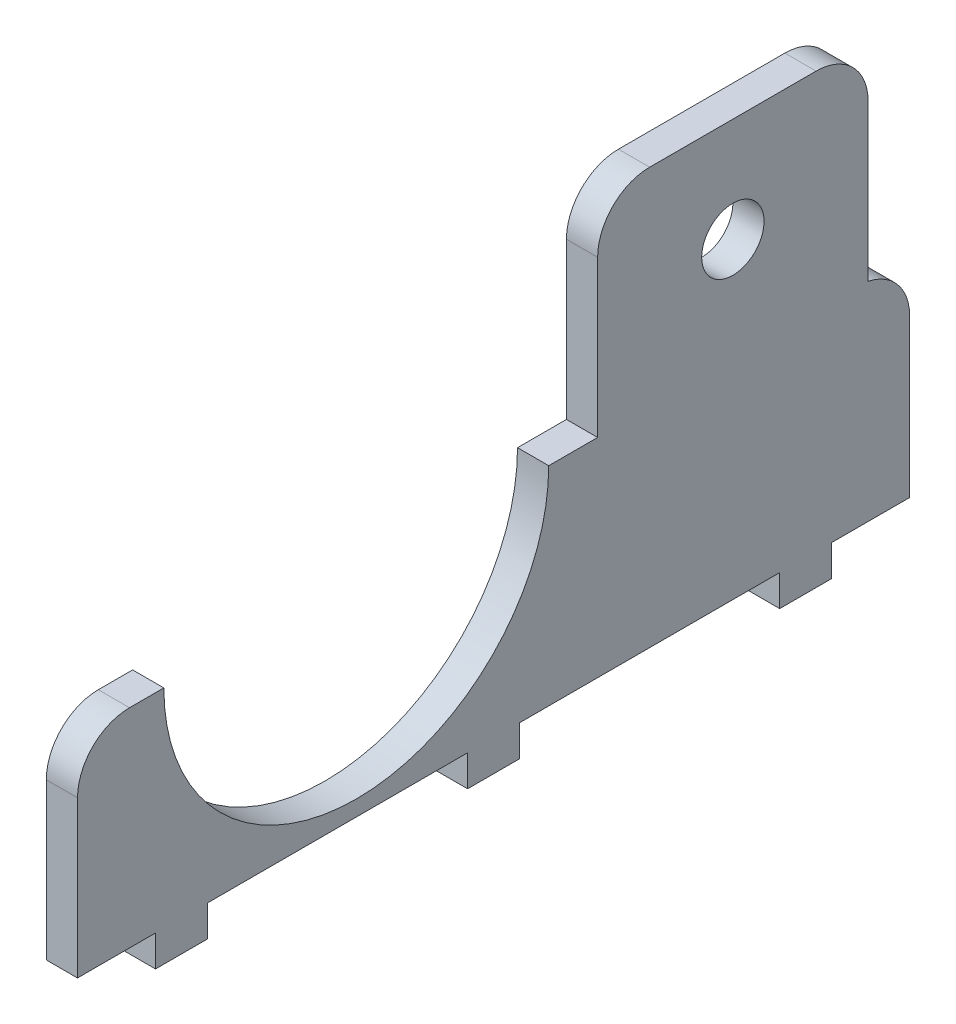
ISO-10303-21;
HEADER;
FILE_DESCRIPTION(('STEP AP214'),'2;1');
FILE_NAME('part.step','',(''),(''),'','','');
FILE_SCHEMA(('AUTOMOTIVE_DESIGN { 1 0 10303 214 1 1 1 1 }'));
ENDSEC;
DATA;
#1=APPLICATION_CONTEXT('core data for automotive mechanical design processes');
#2=APPLICATION_PROTOCOL_DEFINITION('international standard','automotive_design',2000,#1);
#3=PRODUCT_CONTEXT('',#1,'mechanical');
#4=PRODUCT('Part','Part','',(#3));
#5=PRODUCT_RELATED_PRODUCT_CATEGORY('part','',(#4));
#6=PRODUCT_DEFINITION_FORMATION('','',#4);
#7=PRODUCT_DEFINITION_CONTEXT('part definition',#1,'design');
#8=PRODUCT_DEFINITION('design','',#6,#7);
#9=PRODUCT_DEFINITION_SHAPE('','',#8);
#10=(LENGTH_UNIT() NAMED_UNIT(*) SI_UNIT(.MILLI.,.METRE.));
#11=(NAMED_UNIT(*) PLANE_ANGLE_UNIT() SI_UNIT($,.RADIAN.));
#12=(NAMED_UNIT(*) SI_UNIT($,.STERADIAN.) SOLID_ANGLE_UNIT());
#13=UNCERTAINTY_MEASURE_WITH_UNIT(LENGTH_MEASURE(1.E-05),#10,'distance_accuracy_value','');
#14=(GEOMETRIC_REPRESENTATION_CONTEXT(3) GLOBAL_UNCERTAINTY_ASSIGNED_CONTEXT((#13)) GLOBAL_UNIT_ASSIGNED_CONTEXT((#10,
#11,#12)) REPRESENTATION_CONTEXT('',''));
#15=CARTESIAN_POINT('',(0.,0.,0.));
#16=DIRECTION('',(0.,0.,1.));
#17=DIRECTION('',(1.,0.,0.));
#18=AXIS2_PLACEMENT_3D('',#15,#16,#17);
#19=CARTESIAN_POINT('',(3.,-25.,-32.5));
#20=DIRECTION('',(0.,1.,0.));
#21=DIRECTION('',(0.,0.,1.));
#22=AXIS2_PLACEMENT_3D('',#19,#20,#21);
#23=PLANE('',#22);
#24=DIRECTION('',(1.,0.,0.));
#25=VECTOR('',#24,1.);
#26=CARTESIAN_POINT('',(0.,-25.,-25.));
#27=LINE('',#26,#25);
#28=CARTESIAN_POINT('',(0.,-25.,-25.));
#29=VERTEX_POINT('',#28);
#30=CARTESIAN_POINT('',(3.,-25.,-25.));
#31=VERTEX_POINT('',#30);
#32=EDGE_CURVE('E429',#29,#31,#27,.T.);
#33=ORIENTED_EDGE('',*,*,#32,.F.);
#34=DIRECTION('',(0.,0.,-1.));
#35=VECTOR('',#34,1.);
#36=CARTESIAN_POINT('',(0.,-25.,-32.5));
#37=LINE('',#36,#35);
#38=CARTESIAN_POINT('',(0.,-25.,-32.5));
#39=VERTEX_POINT('',#38);
#40=EDGE_CURVE('E229',#29,#39,#37,.T.);
#41=ORIENTED_EDGE('',*,*,#40,.T.);
#42=DIRECTION('',(-1.,0.,0.));
#43=VECTOR('',#42,1.);
#44=CARTESIAN_POINT('',(3.,-25.,-32.5));
#45=LINE('',#44,#43);
#46=CARTESIAN_POINT('',(3.,-25.,-32.5));
#47=VERTEX_POINT('',#46);
#48=EDGE_CURVE('E347',#47,#39,#45,.T.);
#49=ORIENTED_EDGE('',*,*,#48,.F.);
#50=DIRECTION('',(0.,0.,-1.));
#51=VECTOR('',#50,1.);
#52=CARTESIAN_POINT('',(3.,-25.,-32.5));
#53=LINE('',#52,#51);
#54=EDGE_CURVE('E54',#31,#47,#53,.T.);
#55=ORIENTED_EDGE('',*,*,#54,.F.);
#56=EDGE_LOOP('',(#33,#41,#49,#55));
#57=FACE_BOUND('',#56,.T.);
#58=ADVANCED_FACE('F39',(#57),#23,.F.);
#59=DIRECTION('',(-1.,0.,0.));
#60=VECTOR('',#59,1.);
#61=CARTESIAN_POINT('',(0.,-25.,-20.));
#62=LINE('',#61,#60);
#63=CARTESIAN_POINT('',(3.,-25.,-20.));
#64=VERTEX_POINT('',#63);
#65=CARTESIAN_POINT('',(0.,-25.,-20.));
#66=VERTEX_POINT('',#65);
#67=EDGE_CURVE('E62',#64,#66,#62,.T.);
#68=ORIENTED_EDGE('',*,*,#67,.F.);
#69=CARTESIAN_POINT('',(3.,-25.,4.99999999999999));
#70=VERTEX_POINT('',#69);
#71=EDGE_CURVE('E723',#70,#64,#53,.T.);
#72=ORIENTED_EDGE('',*,*,#71,.F.);
#73=DIRECTION('',(1.,0.,0.));
#74=VECTOR('',#73,1.);
#75=CARTESIAN_POINT('',(0.,-25.,4.99999999999999));
#76=LINE('',#75,#74);
#77=CARTESIAN_POINT('',(0.,-25.,4.99999999999999));
#78=VERTEX_POINT('',#77);
#79=EDGE_CURVE('E230',#78,#70,#76,.T.);
#80=ORIENTED_EDGE('',*,*,#79,.F.);
#81=EDGE_CURVE('E426',#78,#66,#37,.T.);
#82=ORIENTED_EDGE('',*,*,#81,.T.);
#83=EDGE_LOOP('',(#68,#72,#80,#82));
#84=FACE_BOUND('',#83,.T.);
#85=ADVANCED_FACE('F478',(#84),#23,.F.);
#86=DIRECTION('',(-1.,0.,0.));
#87=VECTOR('',#86,1.);
#88=CARTESIAN_POINT('',(0.,-25.,9.99999999999999));
#89=LINE('',#88,#87);
#90=CARTESIAN_POINT('',(3.,-25.,9.99999999999999));
#91=VERTEX_POINT('',#90);
#92=CARTESIAN_POINT('',(0.,-25.,9.99999999999999));
#93=VERTEX_POINT('',#92);
#94=EDGE_CURVE('E233',#91,#93,#89,.T.);
#95=ORIENTED_EDGE('',*,*,#94,.F.);
#96=CARTESIAN_POINT('',(3.,-25.,35.));
#97=VERTEX_POINT('',#96);
#98=EDGE_CURVE('E341',#97,#91,#53,.T.);
#99=ORIENTED_EDGE('',*,*,#98,.F.);
#100=DIRECTION('',(1.,0.,0.));
#101=VECTOR('',#100,1.);
#102=CARTESIAN_POINT('',(0.,-25.,35.));
#103=LINE('',#102,#101);
#104=CARTESIAN_POINT('',(0.,-25.,35.));
#105=VERTEX_POINT('',#104);
#106=EDGE_CURVE('E262',#105,#97,#103,.T.);
#107=ORIENTED_EDGE('',*,*,#106,.F.);
#108=EDGE_CURVE('E352',#105,#93,#37,.T.);
#109=ORIENTED_EDGE('',*,*,#108,.T.);
#110=EDGE_LOOP('',(#95,#99,#107,#109));
#111=FACE_BOUND('',#110,.T.);
#112=ADVANCED_FACE('F423',(#111),#23,.F.);
#113=DIRECTION('',(-1.,0.,0.));
#114=VECTOR('',#113,1.);
#115=CARTESIAN_POINT('',(0.,-25.,40.));
#116=LINE('',#115,#114);
#117=CARTESIAN_POINT('',(3.,-25.,40.));
#118=VERTEX_POINT('',#117);
#119=CARTESIAN_POINT('',(0.,-25.,40.));
#120=VERTEX_POINT('',#119);
#121=EDGE_CURVE('E267',#118,#120,#116,.T.);
#122=ORIENTED_EDGE('',*,*,#121,.F.);
#123=CARTESIAN_POINT('',(3.,-25.,47.5));
#124=VERTEX_POINT('',#123);
#125=EDGE_CURVE('E337',#124,#118,#53,.T.);
#126=ORIENTED_EDGE('',*,*,#125,.F.);
#127=DIRECTION('',(-1.,0.,0.));
#128=VECTOR('',#127,1.);
#129=CARTESIAN_POINT('',(3.,-25.,47.5));
#130=LINE('',#129,#128);
#131=CARTESIAN_POINT('',(0.,-25.,47.5));
#132=VERTEX_POINT('',#131);
#133=EDGE_CURVE('E359',#124,#132,#130,.T.);
#134=ORIENTED_EDGE('',*,*,#133,.T.);
#135=EDGE_CURVE('E349',#132,#120,#37,.T.);
#136=ORIENTED_EDGE('',*,*,#135,.T.);
#137=EDGE_LOOP('',(#122,#126,#134,#136));
#138=FACE_BOUND('',#137,.T.);
#139=ADVANCED_FACE('F404',(#138),#23,.F.);
#140=CARTESIAN_POINT('',(3.,-25.,47.5));
#141=DIRECTION('',(0.,0.,-1.));
#142=DIRECTION('',(-1.,0.,0.));
#143=AXIS2_PLACEMENT_3D('',#140,#141,#142);
#144=PLANE('',#143);
#145=DIRECTION('',(0.,-1.,0.));
#146=VECTOR('',#145,1.);
#147=CARTESIAN_POINT('',(3.,-25.,47.5));
#148=LINE('',#147,#146);
#149=CARTESIAN_POINT('',(3.,-9.99999999999999,47.5));
#150=VERTEX_POINT('',#149);
#151=EDGE_CURVE('E334',#150,#124,#148,.T.);
#152=ORIENTED_EDGE('',*,*,#151,.F.);
#153=DIRECTION('',(-1.,0.,0.));
#154=VECTOR('',#153,1.);
#155=CARTESIAN_POINT('',(3.,-9.99999999999999,47.5));
#156=LINE('',#155,#154);
#157=CARTESIAN_POINT('',(0.,-9.99999999999999,47.5));
#158=VERTEX_POINT('',#157);
#159=EDGE_CURVE('E47',#150,#158,#156,.T.);
#160=ORIENTED_EDGE('',*,*,#159,.T.);
#161=DIRECTION('',(0.,-1.,0.));
#162=VECTOR('',#161,1.);
#163=CARTESIAN_POINT('',(0.,-25.,47.5));
#164=LINE('',#163,#162);
#165=EDGE_CURVE('E316',#158,#132,#164,.T.);
#166=ORIENTED_EDGE('',*,*,#165,.T.);
#167=ORIENTED_EDGE('',*,*,#133,.F.);
#168=EDGE_LOOP('',(#152,#160,#166,#167));
#169=FACE_BOUND('',#168,.T.);
#170=ADVANCED_FACE('F394',(#169),#144,.F.);
#171=CARTESIAN_POINT('',(3.,-25.,-32.5));
#172=DIRECTION('',(0.,0.,1.));
#173=DIRECTION('',(1.,0.,0.));
#174=AXIS2_PLACEMENT_3D('',#171,#172,#173);
#175=PLANE('',#174);
#176=DIRECTION('',(0.,1.,0.));
#177=VECTOR('',#176,1.);
#178=CARTESIAN_POINT('',(0.,-25.,-32.5));
#179=LINE('',#178,#177);
#180=CARTESIAN_POINT('',(0.,-9.89897948556634,-32.5));
#181=VERTEX_POINT('',#180);
#182=EDGE_CURVE('E351',#39,#181,#179,.T.);
#183=ORIENTED_EDGE('',*,*,#182,.T.);
#184=DIRECTION('',(-1.,0.,0.));
#185=VECTOR('',#184,1.);
#186=CARTESIAN_POINT('',(3.,-9.89897948556634,-32.5));
#187=LINE('',#186,#185);
#188=CARTESIAN_POINT('',(3.,-9.89897948556634,-32.5));
#189=VERTEX_POINT('',#188);
#190=EDGE_CURVE('E386',#181,#189,#187,.F.);
#191=ORIENTED_EDGE('',*,*,#190,.T.);
#192=DIRECTION('',(0.,1.,0.));
#193=VECTOR('',#192,1.);
#194=CARTESIAN_POINT('',(3.,-25.,-32.5));
#195=LINE('',#194,#193);
#196=EDGE_CURVE('E340',#47,#189,#195,.T.);
#197=ORIENTED_EDGE('',*,*,#196,.F.);
#198=ORIENTED_EDGE('',*,*,#48,.T.);
#199=EDGE_LOOP('',(#183,#191,#197,#198));
#200=FACE_BOUND('',#199,.T.);
#201=ADVANCED_FACE('F431',(#200),#175,.F.);
#202=CARTESIAN_POINT('',(3.,15.,-32.5));
#203=DIRECTION('',(0.,-1.,0.));
#204=DIRECTION('',(0.,0.,-1.));
#205=AXIS2_PLACEMENT_3D('',#202,#203,#204);
#206=PLANE('',#205);
#207=DIRECTION('',(0.,0.,1.));
#208=VECTOR('',#207,1.);
#209=CARTESIAN_POINT('',(0.,15.,-32.5));
#210=LINE('',#209,#208);
#211=CARTESIAN_POINT('',(0.,15.,-23.5));
#212=VERTEX_POINT('',#211);
#213=CARTESIAN_POINT('',(0.,15.,-7.50000000000002));
#214=VERTEX_POINT('',#213);
#215=EDGE_CURVE('E336',#212,#214,#210,.T.);
#216=ORIENTED_EDGE('',*,*,#215,.T.);
#217=DIRECTION('',(-1.,0.,0.));
#218=VECTOR('',#217,1.);
#219=CARTESIAN_POINT('',(3.,15.,-7.50000000000002));
#220=LINE('',#219,#218);
#221=CARTESIAN_POINT('',(3.,15.,-7.50000000000002));
#222=VERTEX_POINT('',#221);
#223=EDGE_CURVE('E376',#214,#222,#220,.F.);
#224=ORIENTED_EDGE('',*,*,#223,.T.);
#225=DIRECTION('',(0.,0.,1.));
#226=VECTOR('',#225,1.);
#227=CARTESIAN_POINT('',(3.,15.,-32.5));
#228=LINE('',#227,#226);
#229=CARTESIAN_POINT('',(3.,15.,-23.5));
#230=VERTEX_POINT('',#229);
#231=EDGE_CURVE('E344',#230,#222,#228,.T.);
#232=ORIENTED_EDGE('',*,*,#231,.F.);
#233=DIRECTION('',(-1.,0.,0.));
#234=VECTOR('',#233,1.);
#235=CARTESIAN_POINT('',(3.,15.,-23.5));
#236=LINE('',#235,#234);
#237=EDGE_CURVE('E373',#230,#212,#236,.T.);
#238=ORIENTED_EDGE('',*,*,#237,.T.);
#239=EDGE_LOOP('',(#216,#224,#232,#238));
#240=FACE_BOUND('',#239,.T.);
#241=ADVANCED_FACE('F449',(#240),#206,.F.);
#242=CARTESIAN_POINT('',(3.,0.,0.));
#243=DIRECTION('',(1.,0.,0.));
#244=DIRECTION('',(0.,0.,-1.));
#245=AXIS2_PLACEMENT_3D('',#242,#243,#244);
#246=PLANE('',#245);
#247=ORIENTED_EDGE('',*,*,#231,.T.);
#248=CARTESIAN_POINT('',(3.,10.,-7.50000000000002));
#249=DIRECTION('',(1.,0.,0.));
#250=DIRECTION('',(0.,0.,-1.));
#251=AXIS2_PLACEMENT_3D('',#248,#249,#250);
#252=CIRCLE('',#251,5.);
#253=CARTESIAN_POINT('',(3.,10.,-2.50000000000002));
#254=VERTEX_POINT('',#253);
#255=EDGE_CURVE('E384',#222,#254,#252,.T.);
#256=ORIENTED_EDGE('',*,*,#255,.T.);
#257=DIRECTION('',(0.,-1.,0.));
#258=VECTOR('',#257,1.);
#259=CARTESIAN_POINT('',(3.,-4.99999999999999,-2.50000000000002));
#260=LINE('',#259,#258);
#261=CARTESIAN_POINT('',(3.,-4.99999999999999,-2.50000000000002));
#262=VERTEX_POINT('',#261);
#263=EDGE_CURVE('E290',#254,#262,#260,.T.);
#264=ORIENTED_EDGE('',*,*,#263,.T.);
#265=DIRECTION('',(0.,0.,1.));
#266=VECTOR('',#265,1.);
#267=CARTESIAN_POINT('',(3.,-4.99999999999999,2.19999999999999));
#268=LINE('',#267,#266);
#269=CARTESIAN_POINT('',(3.,-4.99999999999999,2.19999999999999));
#270=VERTEX_POINT('',#269);
#271=EDGE_CURVE('E292',#262,#270,#268,.T.);
#272=ORIENTED_EDGE('',*,*,#271,.T.);
#273=CARTESIAN_POINT('',(3.,-4.99999999999999,20.7));
#274=DIRECTION('',(-1.,0.,0.));
#275=DIRECTION('',(0.,0.,1.));
#276=AXIS2_PLACEMENT_3D('',#273,#274,#275);
#277=CIRCLE('',#276,18.5);
#278=CARTESIAN_POINT('',(3.,-4.99999999999999,39.2));
#279=VERTEX_POINT('',#278);
#280=EDGE_CURVE('E296',#270,#279,#277,.T.);
#281=ORIENTED_EDGE('',*,*,#280,.T.);
#282=DIRECTION('',(0.,0.,1.));
#283=VECTOR('',#282,1.);
#284=CARTESIAN_POINT('',(3.,-4.99999999999999,39.2));
#285=LINE('',#284,#283);
#286=CARTESIAN_POINT('',(3.,-4.99999999999999,42.5));
#287=VERTEX_POINT('',#286);
#288=EDGE_CURVE('E299',#279,#287,#285,.T.);
#289=ORIENTED_EDGE('',*,*,#288,.T.);
#290=CARTESIAN_POINT('',(3.,-9.99999999999999,42.5));
#291=DIRECTION('',(1.,0.,0.));
#292=DIRECTION('',(0.,0.,-1.));
#293=AXIS2_PLACEMENT_3D('',#290,#291,#292);
#294=CIRCLE('',#293,5.);
#295=EDGE_CURVE('E378',#287,#150,#294,.T.);
#296=ORIENTED_EDGE('',*,*,#295,.T.);
#297=ORIENTED_EDGE('',*,*,#151,.T.);
#298=ORIENTED_EDGE('',*,*,#125,.T.);
#299=DIRECTION('',(0.,1.,0.));
#300=VECTOR('',#299,1.);
#301=CARTESIAN_POINT('',(3.,-28.,40.));
#302=LINE('',#301,#300);
#303=CARTESIAN_POINT('',(3.,-28.,40.));
#304=VERTEX_POINT('',#303);
#305=EDGE_CURVE('E280',#304,#118,#302,.T.);
#306=ORIENTED_EDGE('',*,*,#305,.F.);
#307=DIRECTION('',(0.,0.,1.));
#308=VECTOR('',#307,1.);
#309=CARTESIAN_POINT('',(3.,-28.,40.));
#310=LINE('',#309,#308);
#311=CARTESIAN_POINT('',(3.,-28.,35.));
#312=VERTEX_POINT('',#311);
#313=EDGE_CURVE('E269',#312,#304,#310,.T.);
#314=ORIENTED_EDGE('',*,*,#313,.F.);
#315=DIRECTION('',(0.,1.,0.));
#316=VECTOR('',#315,1.);
#317=CARTESIAN_POINT('',(3.,-28.,35.));
#318=LINE('',#317,#316);
#319=EDGE_CURVE('E283',#312,#97,#318,.T.);
#320=ORIENTED_EDGE('',*,*,#319,.T.);
#321=ORIENTED_EDGE('',*,*,#98,.T.);
#322=DIRECTION('',(0.,1.,0.));
#323=VECTOR('',#322,1.);
#324=CARTESIAN_POINT('',(3.,-28.,9.99999999999999));
#325=LINE('',#324,#323);
#326=CARTESIAN_POINT('',(3.,-28.,9.99999999999999));
#327=VERTEX_POINT('',#326);
#328=EDGE_CURVE('E253',#327,#91,#325,.T.);
#329=ORIENTED_EDGE('',*,*,#328,.F.);
#330=DIRECTION('',(0.,0.,1.));
#331=VECTOR('',#330,1.);
#332=CARTESIAN_POINT('',(3.,-28.,9.99999999999999));
#333=LINE('',#332,#331);
#334=CARTESIAN_POINT('',(3.,-28.,4.99999999999999));
#335=VERTEX_POINT('',#334);
#336=EDGE_CURVE('E244',#335,#327,#333,.T.);
#337=ORIENTED_EDGE('',*,*,#336,.F.);
#338=DIRECTION('',(0.,1.,0.));
#339=VECTOR('',#338,1.);
#340=CARTESIAN_POINT('',(3.,-28.,4.99999999999999));
#341=LINE('',#340,#339);
#342=EDGE_CURVE('E256',#335,#70,#341,.T.);
#343=ORIENTED_EDGE('',*,*,#342,.T.);
#344=ORIENTED_EDGE('',*,*,#71,.T.);
#345=DIRECTION('',(0.,1.,0.));
#346=VECTOR('',#345,1.);
#347=CARTESIAN_POINT('',(3.,-28.,-20.));
#348=LINE('',#347,#346);
#349=CARTESIAN_POINT('',(3.,-28.,-20.));
#350=VERTEX_POINT('',#349);
#351=EDGE_CURVE('E235',#350,#64,#348,.T.);
#352=ORIENTED_EDGE('',*,*,#351,.F.);
#353=DIRECTION('',(0.,0.,1.));
#354=VECTOR('',#353,1.);
#355=CARTESIAN_POINT('',(3.,-28.,-20.));
#356=LINE('',#355,#354);
#357=CARTESIAN_POINT('',(3.,-28.,-25.));
#358=VERTEX_POINT('',#357);
#359=EDGE_CURVE('E215',#358,#350,#356,.T.);
#360=ORIENTED_EDGE('',*,*,#359,.F.);
#361=DIRECTION('',(0.,1.,0.));
#362=VECTOR('',#361,1.);
#363=CARTESIAN_POINT('',(3.,-28.,-25.));
#364=LINE('',#363,#362);
#365=EDGE_CURVE('E212',#358,#31,#364,.T.);
#366=ORIENTED_EDGE('',*,*,#365,.T.);
#367=ORIENTED_EDGE('',*,*,#54,.T.);
#368=ORIENTED_EDGE('',*,*,#196,.T.);
#369=CARTESIAN_POINT('',(3.,-9.89897948556634,-27.5));
#370=DIRECTION('',(1.,0.,0.));
#371=DIRECTION('',(0.,0.,-1.));
#372=AXIS2_PLACEMENT_3D('',#369,#370,#371);
#373=CIRCLE('',#372,5.);
#374=CARTESIAN_POINT('',(3.,-4.99999999999998,-28.5));
#375=VERTEX_POINT('',#374);
#376=EDGE_CURVE('E382',#189,#375,#373,.T.);
#377=ORIENTED_EDGE('',*,*,#376,.T.);
#378=DIRECTION('',(0.,1.,0.));
#379=VECTOR('',#378,1.);
#380=CARTESIAN_POINT('',(3.,-4.99999999999998,-28.5));
#381=LINE('',#380,#379);
#382=CARTESIAN_POINT('',(3.,10.,-28.5));
#383=VERTEX_POINT('',#382);
#384=EDGE_CURVE('E327',#375,#383,#381,.T.);
#385=ORIENTED_EDGE('',*,*,#384,.T.);
#386=CARTESIAN_POINT('',(3.,10.,-23.5));
#387=DIRECTION('',(1.,0.,0.));
#388=DIRECTION('',(0.,0.,-1.));
#389=AXIS2_PLACEMENT_3D('',#386,#387,#388);
#390=CIRCLE('',#389,5.);
#391=EDGE_CURVE('E380',#383,#230,#390,.T.);
#392=ORIENTED_EDGE('',*,*,#391,.T.);
#393=EDGE_LOOP('',(#247,#256,#264,#272,#281,#289,#296,#297,#298,#306,#314,#320,#321,#329,#337,
#343,#344,#352,#360,#366,#367,#368,#377,#385,#392));
#394=FACE_BOUND('',#393,.T.);
#395=CARTESIAN_POINT('',(3.,5.00000000000001,-15.5));
#396=DIRECTION('',(-1.,0.,0.));
#397=DIRECTION('',(0.,0.,1.));
#398=AXIS2_PLACEMENT_3D('',#395,#396,#397);
#399=CIRCLE('',#398,3.);
#400=CARTESIAN_POINT('',(3.,5.00000000000001,-12.5));
#401=VERTEX_POINT('',#400);
#402=EDGE_CURVE('E306',#401,#401,#399,.T.);
#403=ORIENTED_EDGE('',*,*,#402,.T.);
#404=EDGE_LOOP('',(#403));
#405=FACE_BOUND('',#404,.T.);
#406=ADVANCED_FACE('F407',(#394,#405),#246,.T.);
#407=CARTESIAN_POINT('',(0.,0.,0.));
#408=DIRECTION('',(1.,0.,0.));
#409=DIRECTION('',(0.,0.,-1.));
#410=AXIS2_PLACEMENT_3D('',#407,#408,#409);
#411=PLANE('',#410);
#412=CARTESIAN_POINT('',(0.,5.00000000000001,-15.5));
#413=DIRECTION('',(-1.,0.,0.));
#414=DIRECTION('',(0.,0.,1.));
#415=AXIS2_PLACEMENT_3D('',#412,#413,#414);
#416=CIRCLE('',#415,3.);
#417=CARTESIAN_POINT('',(0.,5.00000000000001,-12.5));
#418=VERTEX_POINT('',#417);
#419=EDGE_CURVE('E323',#418,#418,#416,.T.);
#420=ORIENTED_EDGE('',*,*,#419,.F.);
#421=EDGE_LOOP('',(#420));
#422=FACE_BOUND('',#421,.T.);
#423=DIRECTION('',(0.,-1.,0.));
#424=VECTOR('',#423,1.);
#425=CARTESIAN_POINT('',(0.,-4.99999999999999,-2.50000000000002));
#426=LINE('',#425,#424);
#427=CARTESIAN_POINT('',(0.,10.,-2.50000000000002));
#428=VERTEX_POINT('',#427);
#429=CARTESIAN_POINT('',(0.,-4.99999999999999,-2.50000000000002));
#430=VERTEX_POINT('',#429);
#431=EDGE_CURVE('E303',#428,#430,#426,.T.);
#432=ORIENTED_EDGE('',*,*,#431,.F.);
#433=CARTESIAN_POINT('',(0.,10.,-7.50000000000002));
#434=DIRECTION('',(1.,0.,0.));
#435=DIRECTION('',(0.,0.,-1.));
#436=AXIS2_PLACEMENT_3D('',#433,#434,#435);
#437=CIRCLE('',#436,5.);
#438=EDGE_CURVE('E371',#428,#214,#437,.F.);
#439=ORIENTED_EDGE('',*,*,#438,.T.);
#440=ORIENTED_EDGE('',*,*,#215,.F.);
#441=CARTESIAN_POINT('',(0.,10.,-23.5));
#442=DIRECTION('',(1.,0.,0.));
#443=DIRECTION('',(0.,0.,-1.));
#444=AXIS2_PLACEMENT_3D('',#441,#442,#443);
#445=CIRCLE('',#444,5.);
#446=CARTESIAN_POINT('',(0.,10.,-28.5));
#447=VERTEX_POINT('',#446);
#448=EDGE_CURVE('E367',#212,#447,#445,.F.);
#449=ORIENTED_EDGE('',*,*,#448,.T.);
#450=DIRECTION('',(0.,1.,0.));
#451=VECTOR('',#450,1.);
#452=CARTESIAN_POINT('',(0.,-4.99999999999998,-28.5));
#453=LINE('',#452,#451);
#454=CARTESIAN_POINT('',(0.,-4.99999999999998,-28.5));
#455=VERTEX_POINT('',#454);
#456=EDGE_CURVE('E289',#455,#447,#453,.T.);
#457=ORIENTED_EDGE('',*,*,#456,.F.);
#458=CARTESIAN_POINT('',(0.,-9.89897948556634,-27.5));
#459=DIRECTION('',(1.,0.,0.));
#460=DIRECTION('',(0.,0.,-1.));
#461=AXIS2_PLACEMENT_3D('',#458,#459,#460);
#462=CIRCLE('',#461,5.);
#463=EDGE_CURVE('E369',#455,#181,#462,.F.);
#464=ORIENTED_EDGE('',*,*,#463,.T.);
#465=ORIENTED_EDGE('',*,*,#182,.F.);
#466=ORIENTED_EDGE('',*,*,#40,.F.);
#467=DIRECTION('',(0.,1.,0.));
#468=VECTOR('',#467,1.);
#469=CARTESIAN_POINT('',(0.,-28.,-25.));
#470=LINE('',#469,#468);
#471=CARTESIAN_POINT('',(0.,-28.,-25.));
#472=VERTEX_POINT('',#471);
#473=EDGE_CURVE('E210',#472,#29,#470,.T.);
#474=ORIENTED_EDGE('',*,*,#473,.F.);
#475=DIRECTION('',(0.,0.,-1.));
#476=VECTOR('',#475,1.);
#477=CARTESIAN_POINT('',(0.,-28.,-20.));
#478=LINE('',#477,#476);
#479=CARTESIAN_POINT('',(0.,-28.,-20.));
#480=VERTEX_POINT('',#479);
#481=EDGE_CURVE('E216',#480,#472,#478,.T.);
#482=ORIENTED_EDGE('',*,*,#481,.F.);
#483=DIRECTION('',(0.,1.,0.));
#484=VECTOR('',#483,1.);
#485=CARTESIAN_POINT('',(0.,-28.,-20.));
#486=LINE('',#485,#484);
#487=EDGE_CURVE('E715',#480,#66,#486,.T.);
#488=ORIENTED_EDGE('',*,*,#487,.T.);
#489=ORIENTED_EDGE('',*,*,#81,.F.);
#490=DIRECTION('',(0.,1.,0.));
#491=VECTOR('',#490,1.);
#492=CARTESIAN_POINT('',(0.,-28.,4.99999999999999));
#493=LINE('',#492,#491);
#494=CARTESIAN_POINT('',(0.,-28.,4.99999999999999));
#495=VERTEX_POINT('',#494);
#496=EDGE_CURVE('E259',#495,#78,#493,.T.);
#497=ORIENTED_EDGE('',*,*,#496,.F.);
#498=DIRECTION('',(0.,0.,-1.));
#499=VECTOR('',#498,1.);
#500=CARTESIAN_POINT('',(0.,-28.,9.99999999999999));
#501=LINE('',#500,#499);
#502=CARTESIAN_POINT('',(0.,-28.,9.99999999999999));
#503=VERTEX_POINT('',#502);
#504=EDGE_CURVE('E239',#503,#495,#501,.T.);
#505=ORIENTED_EDGE('',*,*,#504,.F.);
#506=DIRECTION('',(0.,1.,0.));
#507=VECTOR('',#506,1.);
#508=CARTESIAN_POINT('',(0.,-28.,9.99999999999999));
#509=LINE('',#508,#507);
#510=EDGE_CURVE('E247',#503,#93,#509,.T.);
#511=ORIENTED_EDGE('',*,*,#510,.T.);
#512=ORIENTED_EDGE('',*,*,#108,.F.);
#513=DIRECTION('',(0.,1.,0.));
#514=VECTOR('',#513,1.);
#515=CARTESIAN_POINT('',(0.,-28.,35.));
#516=LINE('',#515,#514);
#517=CARTESIAN_POINT('',(0.,-28.,35.));
#518=VERTEX_POINT('',#517);
#519=EDGE_CURVE('E286',#518,#105,#516,.T.);
#520=ORIENTED_EDGE('',*,*,#519,.F.);
#521=DIRECTION('',(0.,0.,-1.));
#522=VECTOR('',#521,1.);
#523=CARTESIAN_POINT('',(0.,-28.,40.));
#524=LINE('',#523,#522);
#525=CARTESIAN_POINT('',(0.,-28.,40.));
#526=VERTEX_POINT('',#525);
#527=EDGE_CURVE('E263',#526,#518,#524,.T.);
#528=ORIENTED_EDGE('',*,*,#527,.F.);
#529=DIRECTION('',(0.,1.,0.));
#530=VECTOR('',#529,1.);
#531=CARTESIAN_POINT('',(0.,-28.,40.));
#532=LINE('',#531,#530);
#533=EDGE_CURVE('E273',#526,#120,#532,.T.);
#534=ORIENTED_EDGE('',*,*,#533,.T.);
#535=ORIENTED_EDGE('',*,*,#135,.F.);
#536=ORIENTED_EDGE('',*,*,#165,.F.);
#537=CARTESIAN_POINT('',(0.,-9.99999999999999,42.5));
#538=DIRECTION('',(1.,0.,0.));
#539=DIRECTION('',(0.,0.,-1.));
#540=AXIS2_PLACEMENT_3D('',#537,#538,#539);
#541=CIRCLE('',#540,5.);
#542=CARTESIAN_POINT('',(0.,-4.99999999999999,42.5));
#543=VERTEX_POINT('',#542);
#544=EDGE_CURVE('E365',#158,#543,#541,.F.);
#545=ORIENTED_EDGE('',*,*,#544,.T.);
#546=DIRECTION('',(0.,0.,1.));
#547=VECTOR('',#546,1.);
#548=CARTESIAN_POINT('',(0.,-4.99999999999999,39.2));
#549=LINE('',#548,#547);
#550=CARTESIAN_POINT('',(0.,-4.99999999999999,39.2));
#551=VERTEX_POINT('',#550);
#552=EDGE_CURVE('E293',#551,#543,#549,.T.);
#553=ORIENTED_EDGE('',*,*,#552,.F.);
#554=CARTESIAN_POINT('',(0.,-4.99999999999999,20.7));
#555=DIRECTION('',(-1.,0.,0.));
#556=DIRECTION('',(0.,0.,1.));
#557=AXIS2_PLACEMENT_3D('',#554,#555,#556);
#558=CIRCLE('',#557,18.5);
#559=CARTESIAN_POINT('',(0.,-4.99999999999999,2.19999999999999));
#560=VERTEX_POINT('',#559);
#561=EDGE_CURVE('E309',#560,#551,#558,.T.);
#562=ORIENTED_EDGE('',*,*,#561,.F.);
#563=DIRECTION('',(0.,0.,1.));
#564=VECTOR('',#563,1.);
#565=CARTESIAN_POINT('',(0.,-4.99999999999999,2.19999999999999));
#566=LINE('',#565,#564);
#567=EDGE_CURVE('E305',#430,#560,#566,.T.);
#568=ORIENTED_EDGE('',*,*,#567,.F.);
#569=EDGE_LOOP('',(#432,#439,#440,#449,#457,#464,#465,#466,#474,#482,#488,#489,#497,#505,#511,
#512,#520,#528,#534,#535,#536,#545,#553,#562,#568));
#570=FACE_BOUND('',#569,.T.);
#571=ADVANCED_FACE('F227',(#422,#570),#411,.F.);
#572=CARTESIAN_POINT('',(3.,-4.99999999999998,-28.5));
#573=DIRECTION('',(0.,0.,1.));
#574=DIRECTION('',(1.,0.,0.));
#575=AXIS2_PLACEMENT_3D('',#572,#573,#574);
#576=PLANE('',#575);
#577=ORIENTED_EDGE('',*,*,#456,.T.);
#578=DIRECTION('',(-1.,0.,0.));
#579=VECTOR('',#578,1.);
#580=CARTESIAN_POINT('',(3.,10.,-28.5));
#581=LINE('',#580,#579);
#582=EDGE_CURVE('E388',#447,#383,#581,.F.);
#583=ORIENTED_EDGE('',*,*,#582,.T.);
#584=ORIENTED_EDGE('',*,*,#384,.F.);
#585=DIRECTION('',(-1.,0.,0.));
#586=VECTOR('',#585,1.);
#587=CARTESIAN_POINT('',(3.,-4.99999999999998,-28.5));
#588=LINE('',#587,#586);
#589=EDGE_CURVE('E326',#375,#455,#588,.T.);
#590=ORIENTED_EDGE('',*,*,#589,.T.);
#591=EDGE_LOOP('',(#577,#583,#584,#590));
#592=FACE_BOUND('',#591,.T.);
#593=ADVANCED_FACE('F440',(#592),#576,.F.);
#594=CARTESIAN_POINT('',(3.,5.00000000000001,-15.5));
#595=DIRECTION('',(-1.,0.,0.));
#596=DIRECTION('',(0.,0.,1.));
#597=AXIS2_PLACEMENT_3D('',#594,#595,#596);
#598=CYLINDRICAL_SURFACE('',#597,3.);
#599=ORIENTED_EDGE('',*,*,#402,.F.);
#600=EDGE_LOOP('',(#599));
#601=FACE_BOUND('',#600,.T.);
#602=ORIENTED_EDGE('',*,*,#419,.T.);
#603=EDGE_LOOP('',(#602));
#604=FACE_BOUND('',#603,.T.);
#605=ADVANCED_FACE('F577',(#601,#604),#598,.F.);
#606=CARTESIAN_POINT('',(3.,-4.99999999999999,39.2));
#607=DIRECTION('',(0.,-1.,0.));
#608=DIRECTION('',(0.,0.,-1.));
#609=AXIS2_PLACEMENT_3D('',#606,#607,#608);
#610=PLANE('',#609);
#611=ORIENTED_EDGE('',*,*,#552,.T.);
#612=DIRECTION('',(-1.,0.,0.));
#613=VECTOR('',#612,1.);
#614=CARTESIAN_POINT('',(3.,-4.99999999999999,42.5));
#615=LINE('',#614,#613);
#616=EDGE_CURVE('E11',#543,#287,#615,.F.);
#617=ORIENTED_EDGE('',*,*,#616,.T.);
#618=ORIENTED_EDGE('',*,*,#288,.F.);
#619=DIRECTION('',(-1.,0.,0.));
#620=VECTOR('',#619,1.);
#621=CARTESIAN_POINT('',(3.,-4.99999999999999,39.2));
#622=LINE('',#621,#620);
#623=EDGE_CURVE('E314',#279,#551,#622,.T.);
#624=ORIENTED_EDGE('',*,*,#623,.T.);
#625=EDGE_LOOP('',(#611,#617,#618,#624));
#626=FACE_BOUND('',#625,.T.);
#627=ADVANCED_FACE('F469',(#626),#610,.F.);
#628=CARTESIAN_POINT('',(3.,-4.99999999999999,20.7));
#629=DIRECTION('',(-1.,0.,0.));
#630=DIRECTION('',(0.,0.,1.));
#631=AXIS2_PLACEMENT_3D('',#628,#629,#630);
#632=CYLINDRICAL_SURFACE('',#631,18.5);
#633=ORIENTED_EDGE('',*,*,#561,.T.);
#634=ORIENTED_EDGE('',*,*,#623,.F.);
#635=ORIENTED_EDGE('',*,*,#280,.F.);
#636=DIRECTION('',(-1.,0.,0.));
#637=VECTOR('',#636,1.);
#638=CARTESIAN_POINT('',(3.,-4.99999999999999,2.19999999999999));
#639=LINE('',#638,#637);
#640=EDGE_CURVE('E317',#270,#560,#639,.T.);
#641=ORIENTED_EDGE('',*,*,#640,.T.);
#642=EDGE_LOOP('',(#633,#634,#635,#641));
#643=FACE_BOUND('',#642,.T.);
#644=ADVANCED_FACE('F466',(#643),#632,.F.);
#645=CARTESIAN_POINT('',(3.,-4.99999999999999,2.19999999999999));
#646=DIRECTION('',(0.,-1.,0.));
#647=DIRECTION('',(0.,0.,-1.));
#648=AXIS2_PLACEMENT_3D('',#645,#646,#647);
#649=PLANE('',#648);
#650=ORIENTED_EDGE('',*,*,#567,.T.);
#651=ORIENTED_EDGE('',*,*,#640,.F.);
#652=ORIENTED_EDGE('',*,*,#271,.F.);
#653=DIRECTION('',(-1.,0.,0.));
#654=VECTOR('',#653,1.);
#655=CARTESIAN_POINT('',(3.,-4.99999999999999,-2.50000000000002));
#656=LINE('',#655,#654);
#657=EDGE_CURVE('E302',#262,#430,#656,.T.);
#658=ORIENTED_EDGE('',*,*,#657,.T.);
#659=EDGE_LOOP('',(#650,#651,#652,#658));
#660=FACE_BOUND('',#659,.T.);
#661=ADVANCED_FACE('F463',(#660),#649,.F.);
#662=CARTESIAN_POINT('',(3.,-4.99999999999999,-2.50000000000002));
#663=DIRECTION('',(0.,0.,-1.));
#664=DIRECTION('',(0.,1.,0.));
#665=AXIS2_PLACEMENT_3D('',#662,#663,#664);
#666=PLANE('',#665);
#667=ORIENTED_EDGE('',*,*,#263,.F.);
#668=DIRECTION('',(-1.,0.,0.));
#669=VECTOR('',#668,1.);
#670=CARTESIAN_POINT('',(3.,10.,-2.50000000000002));
#671=LINE('',#670,#669);
#672=EDGE_CURVE('E362',#254,#428,#671,.T.);
#673=ORIENTED_EDGE('',*,*,#672,.T.);
#674=ORIENTED_EDGE('',*,*,#431,.T.);
#675=ORIENTED_EDGE('',*,*,#657,.F.);
#676=EDGE_LOOP('',(#667,#673,#674,#675));
#677=FACE_BOUND('',#676,.T.);
#678=ADVANCED_FACE('F458',(#677),#666,.F.);
#679=CARTESIAN_POINT('',(3.,10.,-7.50000000000002));
#680=DIRECTION('',(-1.,0.,0.));
#681=DIRECTION('',(0.,0.,1.));
#682=AXIS2_PLACEMENT_3D('',#679,#680,#681);
#683=CYLINDRICAL_SURFACE('',#682,5.);
#684=ORIENTED_EDGE('',*,*,#255,.F.);
#685=ORIENTED_EDGE('',*,*,#223,.F.);
#686=ORIENTED_EDGE('',*,*,#438,.F.);
#687=ORIENTED_EDGE('',*,*,#672,.F.);
#688=EDGE_LOOP('',(#684,#685,#686,#687));
#689=FACE_BOUND('',#688,.T.);
#690=ADVANCED_FACE('F455',(#689),#683,.T.);
#691=CARTESIAN_POINT('',(3.,-9.89897948556634,-27.5));
#692=DIRECTION('',(-1.,0.,0.));
#693=DIRECTION('',(0.,0.,1.));
#694=AXIS2_PLACEMENT_3D('',#691,#692,#693);
#695=CYLINDRICAL_SURFACE('',#694,5.);
#696=ORIENTED_EDGE('',*,*,#376,.F.);
#697=ORIENTED_EDGE('',*,*,#190,.F.);
#698=ORIENTED_EDGE('',*,*,#463,.F.);
#699=ORIENTED_EDGE('',*,*,#589,.F.);
#700=EDGE_LOOP('',(#696,#697,#698,#699));
#701=FACE_BOUND('',#700,.T.);
#702=ADVANCED_FACE('F437',(#701),#695,.T.);
#703=CARTESIAN_POINT('',(3.,10.,-23.5));
#704=DIRECTION('',(-1.,0.,0.));
#705=DIRECTION('',(0.,0.,1.));
#706=AXIS2_PLACEMENT_3D('',#703,#704,#705);
#707=CYLINDRICAL_SURFACE('',#706,5.);
#708=ORIENTED_EDGE('',*,*,#391,.F.);
#709=ORIENTED_EDGE('',*,*,#582,.F.);
#710=ORIENTED_EDGE('',*,*,#448,.F.);
#711=ORIENTED_EDGE('',*,*,#237,.F.);
#712=EDGE_LOOP('',(#708,#709,#710,#711));
#713=FACE_BOUND('',#712,.T.);
#714=ADVANCED_FACE('F446',(#713),#707,.T.);
#715=CARTESIAN_POINT('',(3.,-9.99999999999999,42.5));
#716=DIRECTION('',(-1.,0.,0.));
#717=DIRECTION('',(0.,0.,1.));
#718=AXIS2_PLACEMENT_3D('',#715,#716,#717);
#719=CYLINDRICAL_SURFACE('',#718,5.);
#720=ORIENTED_EDGE('',*,*,#295,.F.);
#721=ORIENTED_EDGE('',*,*,#616,.F.);
#722=ORIENTED_EDGE('',*,*,#544,.F.);
#723=ORIENTED_EDGE('',*,*,#159,.F.);
#724=EDGE_LOOP('',(#720,#721,#722,#723));
#725=FACE_BOUND('',#724,.T.);
#726=ADVANCED_FACE('F41',(#725),#719,.T.);
#727=CARTESIAN_POINT('',(0.,-28.,35.));
#728=DIRECTION('',(0.,0.,1.));
#729=DIRECTION('',(0.,-1.,0.));
#730=AXIS2_PLACEMENT_3D('',#727,#728,#729);
#731=PLANE('',#730);
#732=ORIENTED_EDGE('',*,*,#106,.T.);
#733=ORIENTED_EDGE('',*,*,#319,.F.);
#734=DIRECTION('',(1.,0.,0.));
#735=VECTOR('',#734,1.);
#736=CARTESIAN_POINT('',(0.,-28.,35.));
#737=LINE('',#736,#735);
#738=EDGE_CURVE('E266',#518,#312,#737,.T.);
#739=ORIENTED_EDGE('',*,*,#738,.F.);
#740=ORIENTED_EDGE('',*,*,#519,.T.);
#741=EDGE_LOOP('',(#732,#733,#739,#740));
#742=FACE_BOUND('',#741,.T.);
#743=ADVANCED_FACE('F420',(#742),#731,.F.);
#744=CARTESIAN_POINT('',(0.,-28.,40.));
#745=DIRECTION('',(0.,0.,-1.));
#746=DIRECTION('',(0.,1.,0.));
#747=AXIS2_PLACEMENT_3D('',#744,#745,#746);
#748=PLANE('',#747);
#749=ORIENTED_EDGE('',*,*,#121,.T.);
#750=ORIENTED_EDGE('',*,*,#533,.F.);
#751=DIRECTION('',(-1.,0.,0.));
#752=VECTOR('',#751,1.);
#753=CARTESIAN_POINT('',(0.,-28.,40.));
#754=LINE('',#753,#752);
#755=EDGE_CURVE('E271',#304,#526,#754,.T.);
#756=ORIENTED_EDGE('',*,*,#755,.F.);
#757=ORIENTED_EDGE('',*,*,#305,.T.);
#758=EDGE_LOOP('',(#749,#750,#756,#757));
#759=FACE_BOUND('',#758,.T.);
#760=ADVANCED_FACE('F412',(#759),#748,.F.);
#761=CARTESIAN_POINT('',(0.,-28.,0.));
#762=DIRECTION('',(0.,-1.,0.));
#763=DIRECTION('',(0.,0.,-1.));
#764=AXIS2_PLACEMENT_3D('',#761,#762,#763);
#765=PLANE('',#764);
#766=ORIENTED_EDGE('',*,*,#527,.T.);
#767=ORIENTED_EDGE('',*,*,#738,.T.);
#768=ORIENTED_EDGE('',*,*,#313,.T.);
#769=ORIENTED_EDGE('',*,*,#755,.T.);
#770=EDGE_LOOP('',(#766,#767,#768,#769));
#771=FACE_BOUND('',#770,.T.);
#772=ADVANCED_FACE('F414',(#771),#765,.T.);
#773=CARTESIAN_POINT('',(0.,-28.,4.99999999999999));
#774=DIRECTION('',(0.,0.,1.));
#775=DIRECTION('',(0.,-1.,0.));
#776=AXIS2_PLACEMENT_3D('',#773,#774,#775);
#777=PLANE('',#776);
#778=ORIENTED_EDGE('',*,*,#79,.T.);
#779=ORIENTED_EDGE('',*,*,#342,.F.);
#780=DIRECTION('',(1.,0.,0.));
#781=VECTOR('',#780,1.);
#782=CARTESIAN_POINT('',(0.,-28.,4.99999999999999));
#783=LINE('',#782,#781);
#784=EDGE_CURVE('E242',#495,#335,#783,.T.);
#785=ORIENTED_EDGE('',*,*,#784,.F.);
#786=ORIENTED_EDGE('',*,*,#496,.T.);
#787=EDGE_LOOP('',(#778,#779,#785,#786));
#788=FACE_BOUND('',#787,.T.);
#789=ADVANCED_FACE('F511',(#788),#777,.F.);
#790=CARTESIAN_POINT('',(0.,-28.,9.99999999999999));
#791=DIRECTION('',(0.,0.,-1.));
#792=DIRECTION('',(0.,1.,0.));
#793=AXIS2_PLACEMENT_3D('',#790,#791,#792);
#794=PLANE('',#793);
#795=ORIENTED_EDGE('',*,*,#94,.T.);
#796=ORIENTED_EDGE('',*,*,#510,.F.);
#797=DIRECTION('',(-1.,0.,0.));
#798=VECTOR('',#797,1.);
#799=CARTESIAN_POINT('',(0.,-28.,9.99999999999999));
#800=LINE('',#799,#798);
#801=EDGE_CURVE('E246',#327,#503,#800,.T.);
#802=ORIENTED_EDGE('',*,*,#801,.F.);
#803=ORIENTED_EDGE('',*,*,#328,.T.);
#804=EDGE_LOOP('',(#795,#796,#802,#803));
#805=FACE_BOUND('',#804,.T.);
#806=ADVANCED_FACE('F665',(#805),#794,.F.);
#807=CARTESIAN_POINT('',(0.,-28.,-30.));
#808=DIRECTION('',(0.,-1.,0.));
#809=DIRECTION('',(0.,0.,-1.));
#810=AXIS2_PLACEMENT_3D('',#807,#808,#809);
#811=PLANE('',#810);
#812=ORIENTED_EDGE('',*,*,#504,.T.);
#813=ORIENTED_EDGE('',*,*,#784,.T.);
#814=ORIENTED_EDGE('',*,*,#336,.T.);
#815=ORIENTED_EDGE('',*,*,#801,.T.);
#816=EDGE_LOOP('',(#812,#813,#814,#815));
#817=FACE_BOUND('',#816,.T.);
#818=ADVANCED_FACE('F674',(#817),#811,.T.);
#819=CARTESIAN_POINT('',(0.,-28.,-25.));
#820=DIRECTION('',(0.,0.,1.));
#821=DIRECTION('',(0.,-1.,0.));
#822=AXIS2_PLACEMENT_3D('',#819,#820,#821);
#823=PLANE('',#822);
#824=ORIENTED_EDGE('',*,*,#32,.T.);
#825=ORIENTED_EDGE('',*,*,#365,.F.);
#826=DIRECTION('',(1.,0.,0.));
#827=VECTOR('',#826,1.);
#828=CARTESIAN_POINT('',(0.,-28.,-25.));
#829=LINE('',#828,#827);
#830=EDGE_CURVE('E206',#472,#358,#829,.T.);
#831=ORIENTED_EDGE('',*,*,#830,.F.);
#832=ORIENTED_EDGE('',*,*,#473,.T.);
#833=EDGE_LOOP('',(#824,#825,#831,#832));
#834=FACE_BOUND('',#833,.T.);
#835=ADVANCED_FACE('F208',(#834),#823,.F.);
#836=CARTESIAN_POINT('',(0.,-28.,-20.));
#837=DIRECTION('',(0.,0.,-1.));
#838=DIRECTION('',(0.,1.,0.));
#839=AXIS2_PLACEMENT_3D('',#836,#837,#838);
#840=PLANE('',#839);
#841=ORIENTED_EDGE('',*,*,#67,.T.);
#842=ORIENTED_EDGE('',*,*,#487,.F.);
#843=DIRECTION('',(-1.,0.,0.));
#844=VECTOR('',#843,1.);
#845=CARTESIAN_POINT('',(0.,-28.,-20.));
#846=LINE('',#845,#844);
#847=EDGE_CURVE('E221',#350,#480,#846,.T.);
#848=ORIENTED_EDGE('',*,*,#847,.F.);
#849=ORIENTED_EDGE('',*,*,#351,.T.);
#850=EDGE_LOOP('',(#841,#842,#848,#849));
#851=FACE_BOUND('',#850,.T.);
#852=ADVANCED_FACE('F691',(#851),#840,.F.);
#853=CARTESIAN_POINT('',(0.,-28.,-60.));
#854=DIRECTION('',(0.,-1.,0.));
#855=DIRECTION('',(0.,0.,-1.));
#856=AXIS2_PLACEMENT_3D('',#853,#854,#855);
#857=PLANE('',#856);
#858=ORIENTED_EDGE('',*,*,#481,.T.);
#859=ORIENTED_EDGE('',*,*,#830,.T.);
#860=ORIENTED_EDGE('',*,*,#359,.T.);
#861=ORIENTED_EDGE('',*,*,#847,.T.);
#862=EDGE_LOOP('',(#858,#859,#860,#861));
#863=FACE_BOUND('',#862,.T.);
#864=ADVANCED_FACE('F219',(#863),#857,.T.);
#865=CLOSED_SHELL('',(#58,#85,#112,#139,#170,#201,#241,#406,#571,#593,#605,#627,#644,#661,#678,
#690,#702,#714,#726,#743,#760,#772,#789,#806,#818,#835,#852,#864));
#866=MANIFOLD_SOLID_BREP('B2',#865);
#867=ADVANCED_BREP_SHAPE_REPRESENTATION('',(#18,#866),#14);
#868=SHAPE_DEFINITION_REPRESENTATION(#9,#867);
ENDSEC;
END-ISO-10303-21;
